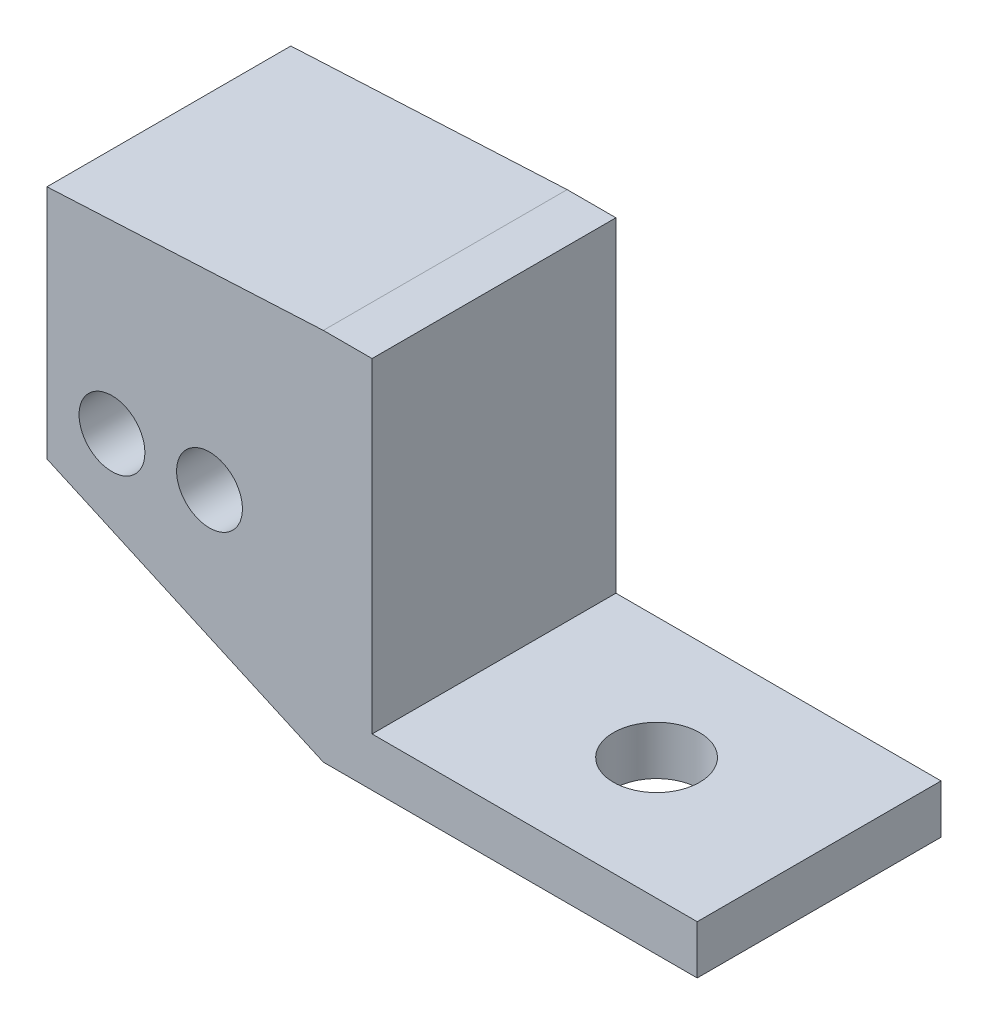
ISO-10303-21;
HEADER;
FILE_DESCRIPTION(('STEP AP214'),'2;1');
FILE_NAME('part.step','',(''),(''),'','','');
FILE_SCHEMA(('AUTOMOTIVE_DESIGN { 1 0 10303 214 1 1 1 1 }'));
ENDSEC;
DATA;
#1=APPLICATION_CONTEXT('core data for automotive mechanical design processes');
#2=APPLICATION_PROTOCOL_DEFINITION('international standard','automotive_design',2000,#1);
#3=PRODUCT_CONTEXT('',#1,'mechanical');
#4=PRODUCT('Part','Part','',(#3));
#5=PRODUCT_RELATED_PRODUCT_CATEGORY('part','',(#4));
#6=PRODUCT_DEFINITION_FORMATION('','',#4);
#7=PRODUCT_DEFINITION_CONTEXT('part definition',#1,'design');
#8=PRODUCT_DEFINITION('design','',#6,#7);
#9=PRODUCT_DEFINITION_SHAPE('','',#8);
#10=(LENGTH_UNIT() NAMED_UNIT(*) SI_UNIT(.MILLI.,.METRE.));
#11=(NAMED_UNIT(*) PLANE_ANGLE_UNIT() SI_UNIT($,.RADIAN.));
#12=(NAMED_UNIT(*) SI_UNIT($,.STERADIAN.) SOLID_ANGLE_UNIT());
#13=UNCERTAINTY_MEASURE_WITH_UNIT(LENGTH_MEASURE(1.E-05),#10,'distance_accuracy_value','');
#14=(GEOMETRIC_REPRESENTATION_CONTEXT(3) GLOBAL_UNCERTAINTY_ASSIGNED_CONTEXT((#13)) GLOBAL_UNIT_ASSIGNED_CONTEXT((#10,
#11,#12)) REPRESENTATION_CONTEXT('',''));
#15=CARTESIAN_POINT('',(0.,0.,0.));
#16=DIRECTION('',(0.,0.,1.));
#17=DIRECTION('',(1.,0.,0.));
#18=AXIS2_PLACEMENT_3D('',#15,#16,#17);
#19=CARTESIAN_POINT('',(56.4899228427824,-77.3158533897185,15.));
#20=DIRECTION('',(0.,0.,-1.));
#21=DIRECTION('',(-1.,0.,0.));
#22=AXIS2_PLACEMENT_3D('',#19,#20,#21);
#23=CYLINDRICAL_SURFACE('',#22,3.02500000000711);
#24=CARTESIAN_POINT('',(56.4899228427824,-77.3158533897185,0.));
#25=DIRECTION('',(0.,0.,1.));
#26=DIRECTION('',(1.,0.,0.));
#27=AXIS2_PLACEMENT_3D('',#24,#25,#26);
#28=CIRCLE('',#27,3.02500000000711);
#29=CARTESIAN_POINT('',(59.5149228427895,-77.3158533897185,0.));
#30=VERTEX_POINT('',#29);
#31=EDGE_CURVE('E137',#30,#30,#28,.T.);
#32=ORIENTED_EDGE('',*,*,#31,.F.);
#33=EDGE_LOOP('',(#32));
#34=FACE_BOUND('',#33,.T.);
#35=CARTESIAN_POINT('',(56.4899228427824,-77.3158533897185,6.));
#36=DIRECTION('',(0.,0.,1.));
#37=DIRECTION('',(1.,0.,0.));
#38=AXIS2_PLACEMENT_3D('',#35,#36,#37);
#39=CIRCLE('',#38,3.02500000000711);
#40=CARTESIAN_POINT('',(59.5149228427895,-77.3158533897185,6.));
#41=VERTEX_POINT('',#40);
#42=EDGE_CURVE('E194',#41,#41,#39,.T.);
#43=ORIENTED_EDGE('',*,*,#42,.T.);
#44=EDGE_LOOP('',(#43));
#45=FACE_BOUND('',#44,.T.);
#46=ADVANCED_FACE('F35',(#34,#45),#23,.F.);
#47=CARTESIAN_POINT('',(0.,0.,15.));
#48=DIRECTION('',(0.,0.,1.));
#49=DIRECTION('',(1.,0.,0.));
#50=AXIS2_PLACEMENT_3D('',#47,#48,#49);
#51=PLANE('',#50);
#52=CARTESIAN_POINT('',(53.4899228427824,-84.3158533897185,15.));
#53=DIRECTION('',(0.,0.,1.));
#54=DIRECTION('',(1.,0.,0.));
#55=AXIS2_PLACEMENT_3D('',#52,#53,#54);
#56=CIRCLE('',#55,2.02500000000711);
#57=CARTESIAN_POINT('',(55.5149228427895,-84.3158533897185,15.));
#58=VERTEX_POINT('',#57);
#59=EDGE_CURVE('E184',#58,#58,#56,.T.);
#60=ORIENTED_EDGE('',*,*,#59,.F.);
#61=EDGE_LOOP('',(#60));
#62=FACE_BOUND('',#61,.T.);
#63=DIRECTION('',(-0.998752338877845,-0.0499376169438925,0.));
#64=VECTOR('',#63,1.);
#65=CARTESIAN_POINT('',(66.4899228427824,-72.3158533897185,15.));
#66=LINE('',#65,#64);
#67=CARTESIAN_POINT('',(66.4899228427824,-72.3158533897185,15.));
#68=VERTEX_POINT('',#67);
#69=CARTESIAN_POINT('',(49.4899228427824,-73.1658533897185,15.));
#70=VERTEX_POINT('',#69);
#71=EDGE_CURVE('E148',#68,#70,#66,.T.);
#72=ORIENTED_EDGE('',*,*,#71,.T.);
#73=DIRECTION('',(0.,-1.,0.));
#74=VECTOR('',#73,1.);
#75=CARTESIAN_POINT('',(49.4899228427824,-73.1658533897185,15.));
#76=LINE('',#75,#74);
#77=CARTESIAN_POINT('',(49.4899228427824,-87.6658533897185,15.));
#78=VERTEX_POINT('',#77);
#79=EDGE_CURVE('E95',#70,#78,#76,.T.);
#80=ORIENTED_EDGE('',*,*,#79,.T.);
#81=DIRECTION('',(0.911921505175107,-0.410364677328797,0.));
#82=VECTOR('',#81,1.);
#83=CARTESIAN_POINT('',(49.4899228427824,-87.6658533897185,15.));
#84=LINE('',#83,#82);
#85=CARTESIAN_POINT('',(66.4899228427824,-95.3158533897185,15.));
#86=VERTEX_POINT('',#85);
#87=EDGE_CURVE('E163',#78,#86,#84,.T.);
#88=ORIENTED_EDGE('',*,*,#87,.T.);
#89=DIRECTION('',(1.,0.,0.));
#90=VECTOR('',#89,1.);
#91=CARTESIAN_POINT('',(66.4899228427824,-95.3158533897185,15.));
#92=LINE('',#91,#90);
#93=CARTESIAN_POINT('',(89.4899228427824,-95.3158533897185,15.));
#94=VERTEX_POINT('',#93);
#95=EDGE_CURVE('E176',#86,#94,#92,.T.);
#96=ORIENTED_EDGE('',*,*,#95,.T.);
#97=DIRECTION('',(0.,1.,0.));
#98=VECTOR('',#97,1.);
#99=CARTESIAN_POINT('',(89.4899228427824,-92.3158533897185,15.));
#100=LINE('',#99,#98);
#101=CARTESIAN_POINT('',(89.4899228427824,-92.3158533897185,15.));
#102=VERTEX_POINT('',#101);
#103=EDGE_CURVE('E115',#94,#102,#100,.T.);
#104=ORIENTED_EDGE('',*,*,#103,.T.);
#105=DIRECTION('',(-1.,0.,0.));
#106=VECTOR('',#105,1.);
#107=CARTESIAN_POINT('',(69.4899228427824,-92.3158533897185,15.));
#108=LINE('',#107,#106);
#109=CARTESIAN_POINT('',(69.4899228427824,-92.3158533897185,15.));
#110=VERTEX_POINT('',#109);
#111=EDGE_CURVE('E108',#102,#110,#108,.T.);
#112=ORIENTED_EDGE('',*,*,#111,.T.);
#113=DIRECTION('',(0.,1.,0.));
#114=VECTOR('',#113,1.);
#115=CARTESIAN_POINT('',(69.4899228427824,-72.3158533897185,15.));
#116=LINE('',#115,#114);
#117=CARTESIAN_POINT('',(69.4899228427824,-72.3158533897185,15.));
#118=VERTEX_POINT('',#117);
#119=EDGE_CURVE('E113',#110,#118,#116,.T.);
#120=ORIENTED_EDGE('',*,*,#119,.T.);
#121=DIRECTION('',(-1.,0.,0.));
#122=VECTOR('',#121,1.);
#123=CARTESIAN_POINT('',(66.4899228427824,-72.3158533897185,15.));
#124=LINE('',#123,#122);
#125=EDGE_CURVE('E52',#118,#68,#124,.T.);
#126=ORIENTED_EDGE('',*,*,#125,.T.);
#127=EDGE_LOOP('',(#72,#80,#88,#96,#104,#112,#120,#126));
#128=FACE_BOUND('',#127,.T.);
#129=CARTESIAN_POINT('',(59.4899228427824,-84.3158533897185,15.));
#130=DIRECTION('',(0.,0.,1.));
#131=DIRECTION('',(1.,0.,0.));
#132=AXIS2_PLACEMENT_3D('',#129,#130,#131);
#133=CIRCLE('',#132,2.02500000000711);
#134=CARTESIAN_POINT('',(61.5149228427895,-84.3158533897185,15.));
#135=VERTEX_POINT('',#134);
#136=EDGE_CURVE('E188',#135,#135,#133,.T.);
#137=ORIENTED_EDGE('',*,*,#136,.F.);
#138=EDGE_LOOP('',(#137));
#139=FACE_BOUND('',#138,.T.);
#140=ADVANCED_FACE('F110',(#62,#128,#139),#51,.T.);
#141=CARTESIAN_POINT('',(0.,0.,0.));
#142=DIRECTION('',(0.,0.,1.));
#143=DIRECTION('',(1.,0.,0.));
#144=AXIS2_PLACEMENT_3D('',#141,#142,#143);
#145=PLANE('',#144);
#146=DIRECTION('',(-0.998752338877845,-0.0499376169438925,0.));
#147=VECTOR('',#146,1.);
#148=CARTESIAN_POINT('',(66.4899228427824,-72.3158533897185,0.));
#149=LINE('',#148,#147);
#150=CARTESIAN_POINT('',(66.4899228427824,-72.3158533897185,0.));
#151=VERTEX_POINT('',#150);
#152=CARTESIAN_POINT('',(49.4899228427824,-73.1658533897185,0.));
#153=VERTEX_POINT('',#152);
#154=EDGE_CURVE('E133',#151,#153,#149,.T.);
#155=ORIENTED_EDGE('',*,*,#154,.F.);
#156=DIRECTION('',(-1.,0.,0.));
#157=VECTOR('',#156,1.);
#158=CARTESIAN_POINT('',(66.4899228427824,-72.3158533897185,0.));
#159=LINE('',#158,#157);
#160=CARTESIAN_POINT('',(69.4899228427824,-72.3158533897185,0.));
#161=VERTEX_POINT('',#160);
#162=EDGE_CURVE('E87',#161,#151,#159,.T.);
#163=ORIENTED_EDGE('',*,*,#162,.F.);
#164=DIRECTION('',(0.,1.,0.));
#165=VECTOR('',#164,1.);
#166=CARTESIAN_POINT('',(69.4899228427824,-72.3158533897185,0.));
#167=LINE('',#166,#165);
#168=CARTESIAN_POINT('',(69.4899228427824,-92.3158533897185,0.));
#169=VERTEX_POINT('',#168);
#170=EDGE_CURVE('E81',#169,#161,#167,.T.);
#171=ORIENTED_EDGE('',*,*,#170,.F.);
#172=DIRECTION('',(-1.,0.,0.));
#173=VECTOR('',#172,1.);
#174=CARTESIAN_POINT('',(69.4899228427824,-92.3158533897185,0.));
#175=LINE('',#174,#173);
#176=CARTESIAN_POINT('',(89.4899228427824,-92.3158533897185,0.));
#177=VERTEX_POINT('',#176);
#178=EDGE_CURVE('E123',#177,#169,#175,.T.);
#179=ORIENTED_EDGE('',*,*,#178,.F.);
#180=DIRECTION('',(0.,1.,0.));
#181=VECTOR('',#180,1.);
#182=CARTESIAN_POINT('',(89.4899228427824,-92.3158533897185,0.));
#183=LINE('',#182,#181);
#184=CARTESIAN_POINT('',(89.4899228427824,-95.3158533897185,0.));
#185=VERTEX_POINT('',#184);
#186=EDGE_CURVE('E143',#185,#177,#183,.T.);
#187=ORIENTED_EDGE('',*,*,#186,.F.);
#188=DIRECTION('',(1.,0.,0.));
#189=VECTOR('',#188,1.);
#190=CARTESIAN_POINT('',(66.4899228427824,-95.3158533897185,0.));
#191=LINE('',#190,#189);
#192=CARTESIAN_POINT('',(66.4899228427824,-95.3158533897185,0.));
#193=VERTEX_POINT('',#192);
#194=EDGE_CURVE('E141',#193,#185,#191,.T.);
#195=ORIENTED_EDGE('',*,*,#194,.F.);
#196=DIRECTION('',(0.911921505175107,-0.410364677328797,0.));
#197=VECTOR('',#196,1.);
#198=CARTESIAN_POINT('',(49.4899228427824,-87.6658533897185,0.));
#199=LINE('',#198,#197);
#200=CARTESIAN_POINT('',(49.4899228427824,-87.6658533897185,0.));
#201=VERTEX_POINT('',#200);
#202=EDGE_CURVE('E139',#201,#193,#199,.T.);
#203=ORIENTED_EDGE('',*,*,#202,.F.);
#204=DIRECTION('',(0.,-1.,0.));
#205=VECTOR('',#204,1.);
#206=CARTESIAN_POINT('',(49.4899228427824,-73.1658533897185,0.));
#207=LINE('',#206,#205);
#208=EDGE_CURVE('E136',#153,#201,#207,.T.);
#209=ORIENTED_EDGE('',*,*,#208,.F.);
#210=EDGE_LOOP('',(#155,#163,#171,#179,#187,#195,#203,#209));
#211=FACE_BOUND('',#210,.T.);
#212=ORIENTED_EDGE('',*,*,#31,.T.);
#213=EDGE_LOOP('',(#212));
#214=FACE_BOUND('',#213,.T.);
#215=CARTESIAN_POINT('',(53.4899228427824,-84.3158533897185,0.));
#216=DIRECTION('',(0.,0.,1.));
#217=DIRECTION('',(1.,0.,0.));
#218=AXIS2_PLACEMENT_3D('',#215,#216,#217);
#219=CIRCLE('',#218,2.02500000000711);
#220=CARTESIAN_POINT('',(55.5149228427895,-84.3158533897185,0.));
#221=VERTEX_POINT('',#220);
#222=EDGE_CURVE('E185',#221,#221,#219,.T.);
#223=ORIENTED_EDGE('',*,*,#222,.T.);
#224=EDGE_LOOP('',(#223));
#225=FACE_BOUND('',#224,.T.);
#226=CARTESIAN_POINT('',(59.4899228427824,-84.3158533897185,0.));
#227=DIRECTION('',(0.,0.,1.));
#228=DIRECTION('',(1.,0.,0.));
#229=AXIS2_PLACEMENT_3D('',#226,#227,#228);
#230=CIRCLE('',#229,2.02500000000711);
#231=CARTESIAN_POINT('',(61.5149228427895,-84.3158533897185,0.));
#232=VERTEX_POINT('',#231);
#233=EDGE_CURVE('E191',#232,#232,#230,.T.);
#234=ORIENTED_EDGE('',*,*,#233,.T.);
#235=EDGE_LOOP('',(#234));
#236=FACE_BOUND('',#235,.T.);
#237=ADVANCED_FACE('F167',(#211,#214,#225,#236),#145,.F.);
#238=CARTESIAN_POINT('',(66.4899228427824,-72.3158533897185,15.));
#239=DIRECTION('',(0.0499376169438925,-0.998752338877845,0.));
#240=DIRECTION('',(0.998752338877845,0.0499376169438925,0.));
#241=AXIS2_PLACEMENT_3D('',#238,#239,#240);
#242=PLANE('',#241);
#243=ORIENTED_EDGE('',*,*,#154,.T.);
#244=DIRECTION('',(0.,0.,-1.));
#245=VECTOR('',#244,1.);
#246=CARTESIAN_POINT('',(49.4899228427824,-73.1658533897185,15.));
#247=LINE('',#246,#245);
#248=EDGE_CURVE('E11',#70,#153,#247,.T.);
#249=ORIENTED_EDGE('',*,*,#248,.F.);
#250=ORIENTED_EDGE('',*,*,#71,.F.);
#251=DIRECTION('',(0.,0.,-1.));
#252=VECTOR('',#251,1.);
#253=CARTESIAN_POINT('',(66.4899228427824,-72.3158533897185,15.));
#254=LINE('',#253,#252);
#255=EDGE_CURVE('E129',#68,#151,#254,.T.);
#256=ORIENTED_EDGE('',*,*,#255,.T.);
#257=EDGE_LOOP('',(#243,#249,#250,#256));
#258=FACE_BOUND('',#257,.T.);
#259=ADVANCED_FACE('F37',(#258),#242,.F.);
#260=CARTESIAN_POINT('',(49.4899228427824,-73.1658533897185,15.));
#261=DIRECTION('',(1.,0.,0.));
#262=DIRECTION('',(0.,0.,-1.));
#263=AXIS2_PLACEMENT_3D('',#260,#261,#262);
#264=PLANE('',#263);
#265=ORIENTED_EDGE('',*,*,#208,.T.);
#266=DIRECTION('',(0.,0.,-1.));
#267=VECTOR('',#266,1.);
#268=CARTESIAN_POINT('',(49.4899228427824,-87.6658533897185,15.));
#269=LINE('',#268,#267);
#270=EDGE_CURVE('E44',#78,#201,#269,.T.);
#271=ORIENTED_EDGE('',*,*,#270,.F.);
#272=ORIENTED_EDGE('',*,*,#79,.F.);
#273=ORIENTED_EDGE('',*,*,#248,.T.);
#274=EDGE_LOOP('',(#265,#271,#272,#273));
#275=FACE_BOUND('',#274,.T.);
#276=ADVANCED_FACE('F215',(#275),#264,.F.);
#277=CARTESIAN_POINT('',(49.4899228427824,-87.6658533897185,15.));
#278=DIRECTION('',(0.410364677328797,0.911921505175107,0.));
#279=DIRECTION('',(-0.911921505175107,0.410364677328797,0.));
#280=AXIS2_PLACEMENT_3D('',#277,#278,#279);
#281=PLANE('',#280);
#282=ORIENTED_EDGE('',*,*,#202,.T.);
#283=DIRECTION('',(0.,0.,-1.));
#284=VECTOR('',#283,1.);
#285=CARTESIAN_POINT('',(66.4899228427824,-95.3158533897185,15.));
#286=LINE('',#285,#284);
#287=EDGE_CURVE('E155',#86,#193,#286,.T.);
#288=ORIENTED_EDGE('',*,*,#287,.F.);
#289=ORIENTED_EDGE('',*,*,#87,.F.);
#290=ORIENTED_EDGE('',*,*,#270,.T.);
#291=EDGE_LOOP('',(#282,#288,#289,#290));
#292=FACE_BOUND('',#291,.T.);
#293=ADVANCED_FACE('F161',(#292),#281,.F.);
#294=CARTESIAN_POINT('',(66.4899228427824,-95.3158533897185,15.));
#295=DIRECTION('',(0.,1.,0.));
#296=DIRECTION('',(0.,0.,1.));
#297=AXIS2_PLACEMENT_3D('',#294,#295,#296);
#298=PLANE('',#297);
#299=CARTESIAN_POINT('',(79.4899228427824,-95.3158533897185,7.5));
#300=DIRECTION('',(0.,-1.,0.));
#301=DIRECTION('',(0.,0.,-1.));
#302=AXIS2_PLACEMENT_3D('',#299,#300,#301);
#303=CIRCLE('',#302,2.6500000000071);
#304=CARTESIAN_POINT('',(79.4899228427824,-95.3158533897185,4.8499999999929));
#305=VERTEX_POINT('',#304);
#306=EDGE_CURVE('E202',#305,#305,#303,.T.);
#307=ORIENTED_EDGE('',*,*,#306,.F.);
#308=EDGE_LOOP('',(#307));
#309=FACE_BOUND('',#308,.T.);
#310=ORIENTED_EDGE('',*,*,#194,.T.);
#311=DIRECTION('',(0.,0.,-1.));
#312=VECTOR('',#311,1.);
#313=CARTESIAN_POINT('',(89.4899228427824,-95.3158533897185,15.));
#314=LINE('',#313,#312);
#315=EDGE_CURVE('E152',#94,#185,#314,.T.);
#316=ORIENTED_EDGE('',*,*,#315,.F.);
#317=ORIENTED_EDGE('',*,*,#95,.F.);
#318=ORIENTED_EDGE('',*,*,#287,.T.);
#319=EDGE_LOOP('',(#310,#316,#317,#318));
#320=FACE_BOUND('',#319,.T.);
#321=ADVANCED_FACE('F172',(#309,#320),#298,.F.);
#322=CARTESIAN_POINT('',(89.4899228427824,-92.3158533897185,15.));
#323=DIRECTION('',(-1.,0.,0.));
#324=DIRECTION('',(0.,0.,1.));
#325=AXIS2_PLACEMENT_3D('',#322,#323,#324);
#326=PLANE('',#325);
#327=ORIENTED_EDGE('',*,*,#186,.T.);
#328=DIRECTION('',(0.,0.,-1.));
#329=VECTOR('',#328,1.);
#330=CARTESIAN_POINT('',(89.4899228427824,-92.3158533897185,15.));
#331=LINE('',#330,#329);
#332=EDGE_CURVE('E124',#102,#177,#331,.T.);
#333=ORIENTED_EDGE('',*,*,#332,.F.);
#334=ORIENTED_EDGE('',*,*,#103,.F.);
#335=ORIENTED_EDGE('',*,*,#315,.T.);
#336=EDGE_LOOP('',(#327,#333,#334,#335));
#337=FACE_BOUND('',#336,.T.);
#338=ADVANCED_FACE('F175',(#337),#326,.F.);
#339=CARTESIAN_POINT('',(69.4899228427824,-92.3158533897185,15.));
#340=DIRECTION('',(0.,-1.,0.));
#341=DIRECTION('',(0.,0.,-1.));
#342=AXIS2_PLACEMENT_3D('',#339,#340,#341);
#343=PLANE('',#342);
#344=CARTESIAN_POINT('',(79.4899228427824,-92.3158533897185,7.5));
#345=DIRECTION('',(0.,-1.,0.));
#346=DIRECTION('',(0.,0.,-1.));
#347=AXIS2_PLACEMENT_3D('',#344,#345,#346);
#348=CIRCLE('',#347,2.6500000000071);
#349=CARTESIAN_POINT('',(79.4899228427824,-92.3158533897185,4.8499999999929));
#350=VERTEX_POINT('',#349);
#351=EDGE_CURVE('E199',#350,#350,#348,.F.);
#352=ORIENTED_EDGE('',*,*,#351,.F.);
#353=EDGE_LOOP('',(#352));
#354=FACE_BOUND('',#353,.T.);
#355=ORIENTED_EDGE('',*,*,#178,.T.);
#356=DIRECTION('',(0.,0.,-1.));
#357=VECTOR('',#356,1.);
#358=CARTESIAN_POINT('',(69.4899228427824,-92.3158533897185,15.));
#359=LINE('',#358,#357);
#360=EDGE_CURVE('E120',#110,#169,#359,.T.);
#361=ORIENTED_EDGE('',*,*,#360,.F.);
#362=ORIENTED_EDGE('',*,*,#111,.F.);
#363=ORIENTED_EDGE('',*,*,#332,.T.);
#364=EDGE_LOOP('',(#355,#361,#362,#363));
#365=FACE_BOUND('',#364,.T.);
#366=ADVANCED_FACE('F121',(#354,#365),#343,.F.);
#367=CARTESIAN_POINT('',(69.4899228427824,-72.3158533897185,15.));
#368=DIRECTION('',(-1.,0.,0.));
#369=DIRECTION('',(0.,0.,1.));
#370=AXIS2_PLACEMENT_3D('',#367,#368,#369);
#371=PLANE('',#370);
#372=ORIENTED_EDGE('',*,*,#170,.T.);
#373=DIRECTION('',(0.,0.,-1.));
#374=VECTOR('',#373,1.);
#375=CARTESIAN_POINT('',(69.4899228427824,-72.3158533897185,15.));
#376=LINE('',#375,#374);
#377=EDGE_CURVE('E125',#118,#161,#376,.T.);
#378=ORIENTED_EDGE('',*,*,#377,.F.);
#379=ORIENTED_EDGE('',*,*,#119,.F.);
#380=ORIENTED_EDGE('',*,*,#360,.T.);
#381=EDGE_LOOP('',(#372,#378,#379,#380));
#382=FACE_BOUND('',#381,.T.);
#383=ADVANCED_FACE('F127',(#382),#371,.F.);
#384=CARTESIAN_POINT('',(66.4899228427824,-72.3158533897185,15.));
#385=DIRECTION('',(0.,-1.,0.));
#386=DIRECTION('',(1.,0.,0.));
#387=AXIS2_PLACEMENT_3D('',#384,#385,#386);
#388=PLANE('',#387);
#389=ORIENTED_EDGE('',*,*,#162,.T.);
#390=ORIENTED_EDGE('',*,*,#255,.F.);
#391=ORIENTED_EDGE('',*,*,#125,.F.);
#392=ORIENTED_EDGE('',*,*,#377,.T.);
#393=EDGE_LOOP('',(#389,#390,#391,#392));
#394=FACE_BOUND('',#393,.T.);
#395=ADVANCED_FACE('F233',(#394),#388,.F.);
#396=CARTESIAN_POINT('',(53.4899228427824,-84.3158533897185,15.));
#397=DIRECTION('',(0.,0.,-1.));
#398=DIRECTION('',(-1.,0.,0.));
#399=AXIS2_PLACEMENT_3D('',#396,#397,#398);
#400=CYLINDRICAL_SURFACE('',#399,2.02500000000711);
#401=ORIENTED_EDGE('',*,*,#59,.T.);
#402=EDGE_LOOP('',(#401));
#403=FACE_BOUND('',#402,.T.);
#404=ORIENTED_EDGE('',*,*,#222,.F.);
#405=EDGE_LOOP('',(#404));
#406=FACE_BOUND('',#405,.T.);
#407=ADVANCED_FACE('F228',(#403,#406),#400,.F.);
#408=CARTESIAN_POINT('',(59.4899228427824,-84.3158533897185,15.));
#409=DIRECTION('',(0.,0.,-1.));
#410=DIRECTION('',(-1.,0.,0.));
#411=AXIS2_PLACEMENT_3D('',#408,#409,#410);
#412=CYLINDRICAL_SURFACE('',#411,2.02500000000711);
#413=ORIENTED_EDGE('',*,*,#136,.T.);
#414=EDGE_LOOP('',(#413));
#415=FACE_BOUND('',#414,.T.);
#416=ORIENTED_EDGE('',*,*,#233,.F.);
#417=EDGE_LOOP('',(#416));
#418=FACE_BOUND('',#417,.T.);
#419=ADVANCED_FACE('F250',(#415,#418),#412,.F.);
#420=CARTESIAN_POINT('',(0.,0.,6.));
#421=DIRECTION('',(0.,0.,1.));
#422=DIRECTION('',(1.,0.,0.));
#423=AXIS2_PLACEMENT_3D('',#420,#421,#422);
#424=PLANE('',#423);
#425=ORIENTED_EDGE('',*,*,#42,.F.);
#426=EDGE_LOOP('',(#425));
#427=FACE_BOUND('',#426,.T.);
#428=ADVANCED_FACE('F245',(#427),#424,.F.);
#429=CARTESIAN_POINT('',(79.4899228427824,-84.820521509121,7.5));
#430=DIRECTION('',(0.,-1.,0.));
#431=DIRECTION('',(0.,0.,-1.));
#432=AXIS2_PLACEMENT_3D('',#429,#430,#431);
#433=CYLINDRICAL_SURFACE('',#432,2.6500000000071);
#434=ORIENTED_EDGE('',*,*,#351,.T.);
#435=EDGE_LOOP('',(#434));
#436=FACE_BOUND('',#435,.T.);
#437=ORIENTED_EDGE('',*,*,#306,.T.);
#438=EDGE_LOOP('',(#437));
#439=FACE_BOUND('',#438,.T.);
#440=ADVANCED_FACE('F206',(#436,#439),#433,.F.);
#441=CLOSED_SHELL('',(#46,#140,#237,#259,#276,#293,#321,#338,#366,#383,#395,#407,#419,#428,#440));
#442=MANIFOLD_SOLID_BREP('B2',#441);
#443=ADVANCED_BREP_SHAPE_REPRESENTATION('',(#18,#442),#14);
#444=SHAPE_DEFINITION_REPRESENTATION(#9,#443);
ENDSEC;
END-ISO-10303-21;
